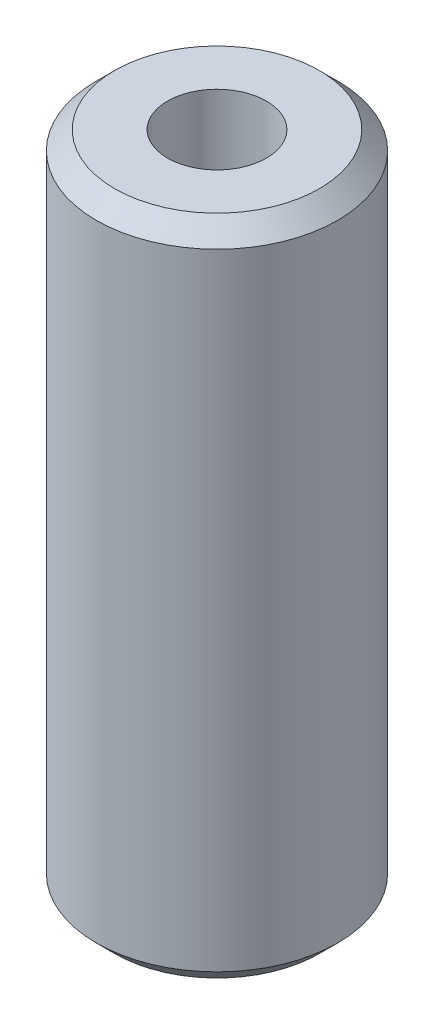
ISO-10303-21;
HEADER;
FILE_DESCRIPTION(('STEP AP214'),'2;1');
FILE_NAME('part.step','',(''),(''),'','','');
FILE_SCHEMA(('AUTOMOTIVE_DESIGN { 1 0 10303 214 1 1 1 1 }'));
ENDSEC;
DATA;
#1=APPLICATION_CONTEXT('core data for automotive mechanical design processes');
#2=APPLICATION_PROTOCOL_DEFINITION('international standard','automotive_design',2000,#1);
#3=PRODUCT_CONTEXT('',#1,'mechanical');
#4=PRODUCT('Part','Part','',(#3));
#5=PRODUCT_RELATED_PRODUCT_CATEGORY('part','',(#4));
#6=PRODUCT_DEFINITION_FORMATION('','',#4);
#7=PRODUCT_DEFINITION_CONTEXT('part definition',#1,'design');
#8=PRODUCT_DEFINITION('design','',#6,#7);
#9=PRODUCT_DEFINITION_SHAPE('','',#8);
#10=(LENGTH_UNIT() NAMED_UNIT(*) SI_UNIT(.MILLI.,.METRE.));
#11=(NAMED_UNIT(*) PLANE_ANGLE_UNIT() SI_UNIT($,.RADIAN.));
#12=(NAMED_UNIT(*) SI_UNIT($,.STERADIAN.) SOLID_ANGLE_UNIT());
#13=UNCERTAINTY_MEASURE_WITH_UNIT(LENGTH_MEASURE(1.E-05),#10,'distance_accuracy_value','');
#14=(GEOMETRIC_REPRESENTATION_CONTEXT(3) GLOBAL_UNCERTAINTY_ASSIGNED_CONTEXT((#13)) GLOBAL_UNIT_ASSIGNED_CONTEXT((#10,
#11,#12)) REPRESENTATION_CONTEXT('',''));
#15=CARTESIAN_POINT('',(0.,0.,0.));
#16=DIRECTION('',(0.,0.,1.));
#17=DIRECTION('',(1.,0.,0.));
#18=AXIS2_PLACEMENT_3D('',#15,#16,#17);
#19=CARTESIAN_POINT('',(0.,54.8902816735799,0.));
#20=DIRECTION('',(0.,-1.,0.));
#21=DIRECTION('',(0.,0.,-1.));
#22=AXIS2_PLACEMENT_3D('',#19,#20,#21);
#23=CYLINDRICAL_SURFACE('',#22,10.);
#24=CARTESIAN_POINT('',(0.,53.3745853184325,0.));
#25=DIRECTION('',(0.,1.,0.));
#26=DIRECTION('',(0.,0.,1.));
#27=AXIS2_PLACEMENT_3D('',#24,#25,#26);
#28=CIRCLE('',#27,10.);
#29=CARTESIAN_POINT('',(0.,53.3745853184325,10.));
#30=VERTEX_POINT('',#29);
#31=EDGE_CURVE('E50',#30,#30,#28,.F.);
#32=ORIENTED_EDGE('',*,*,#31,.T.);
#33=EDGE_LOOP('',(#32));
#34=FACE_BOUND('',#33,.T.);
#35=CARTESIAN_POINT('',(0.,1.51569635514739,0.));
#36=DIRECTION('',(0.,1.,0.));
#37=DIRECTION('',(0.,0.,1.));
#38=AXIS2_PLACEMENT_3D('',#35,#36,#37);
#39=CIRCLE('',#38,10.);
#40=CARTESIAN_POINT('',(0.,1.51569635514739,10.));
#41=VERTEX_POINT('',#40);
#42=EDGE_CURVE('E51',#41,#41,#39,.T.);
#43=ORIENTED_EDGE('',*,*,#42,.T.);
#44=EDGE_LOOP('',(#43));
#45=FACE_BOUND('',#44,.T.);
#46=ADVANCED_FACE('F39',(#34,#45),#23,.T.);
#47=CARTESIAN_POINT('',(0.,54.8902816735799,0.));
#48=DIRECTION('',(0.,1.,0.));
#49=DIRECTION('',(0.,0.,1.));
#50=AXIS2_PLACEMENT_3D('',#47,#48,#49);
#51=PLANE('',#50);
#52=CARTESIAN_POINT('',(0.,54.8902816735799,0.));
#53=DIRECTION('',(0.,1.,0.));
#54=DIRECTION('',(0.,0.,1.));
#55=AXIS2_PLACEMENT_3D('',#52,#53,#54);
#56=CIRCLE('',#55,8.48430364485261);
#57=CARTESIAN_POINT('',(0.,54.8902816735799,8.48430364485261));
#58=VERTEX_POINT('',#57);
#59=EDGE_CURVE('E54',#58,#58,#56,.T.);
#60=ORIENTED_EDGE('',*,*,#59,.T.);
#61=EDGE_LOOP('',(#60));
#62=FACE_BOUND('',#61,.T.);
#63=CARTESIAN_POINT('',(0.,54.8902816735799,0.));
#64=DIRECTION('',(0.,1.,0.));
#65=DIRECTION('',(0.,0.,1.));
#66=AXIS2_PLACEMENT_3D('',#63,#64,#65);
#67=CIRCLE('',#66,4.09878857925724);
#68=CARTESIAN_POINT('',(0.,54.8902816735799,4.09878857925724));
#69=VERTEX_POINT('',#68);
#70=EDGE_CURVE('E58',#69,#69,#67,.T.);
#71=ORIENTED_EDGE('',*,*,#70,.F.);
#72=EDGE_LOOP('',(#71));
#73=FACE_BOUND('',#72,.T.);
#74=ADVANCED_FACE('F69',(#62,#73),#51,.T.);
#75=CARTESIAN_POINT('',(0.,0.,0.));
#76=DIRECTION('',(0.,1.,0.));
#77=DIRECTION('',(0.,0.,1.));
#78=AXIS2_PLACEMENT_3D('',#75,#76,#77);
#79=PLANE('',#78);
#80=CARTESIAN_POINT('',(0.,0.,0.));
#81=DIRECTION('',(0.,1.,0.));
#82=DIRECTION('',(0.,0.,1.));
#83=AXIS2_PLACEMENT_3D('',#80,#81,#82);
#84=CIRCLE('',#83,8.48430364485259);
#85=CARTESIAN_POINT('',(0.,0.,8.48430364485259));
#86=VERTEX_POINT('',#85);
#87=EDGE_CURVE('E10',#86,#86,#84,.F.);
#88=ORIENTED_EDGE('',*,*,#87,.T.);
#89=EDGE_LOOP('',(#88));
#90=FACE_BOUND('',#89,.T.);
#91=CARTESIAN_POINT('',(0.,0.,0.));
#92=DIRECTION('',(0.,1.,0.));
#93=DIRECTION('',(0.,0.,1.));
#94=AXIS2_PLACEMENT_3D('',#91,#92,#93);
#95=CIRCLE('',#94,4.09878857925724);
#96=CARTESIAN_POINT('',(0.,0.,4.09878857925724));
#97=VERTEX_POINT('',#96);
#98=EDGE_CURVE('E63',#97,#97,#95,.T.);
#99=ORIENTED_EDGE('',*,*,#98,.T.);
#100=EDGE_LOOP('',(#99));
#101=FACE_BOUND('',#100,.T.);
#102=ADVANCED_FACE('F75',(#90,#101),#79,.F.);
#103=CARTESIAN_POINT('',(0.,54.8902816735799,0.));
#104=DIRECTION('',(0.,-1.,0.));
#105=DIRECTION('',(0.,0.,-1.));
#106=AXIS2_PLACEMENT_3D('',#103,#104,#105);
#107=CYLINDRICAL_SURFACE('',#106,4.09878857925724);
#108=ORIENTED_EDGE('',*,*,#70,.T.);
#109=EDGE_LOOP('',(#108));
#110=FACE_BOUND('',#109,.T.);
#111=ORIENTED_EDGE('',*,*,#98,.F.);
#112=EDGE_LOOP('',(#111));
#113=FACE_BOUND('',#112,.T.);
#114=ADVANCED_FACE('F70',(#110,#113),#107,.F.);
#115=CARTESIAN_POINT('',(0.,54.8902816735799,0.));
#116=DIRECTION('',(0.,-1.,0.));
#117=DIRECTION('',(0.,0.,-1.));
#118=AXIS2_PLACEMENT_3D('',#115,#116,#117);
#119=CONICAL_SURFACE('',#118,8.48430364485261,0.785398163397448);
#120=ORIENTED_EDGE('',*,*,#31,.F.);
#121=EDGE_LOOP('',(#120));
#122=FACE_BOUND('',#121,.T.);
#123=ORIENTED_EDGE('',*,*,#59,.F.);
#124=EDGE_LOOP('',(#123));
#125=FACE_BOUND('',#124,.T.);
#126=ADVANCED_FACE('F81',(#122,#125),#119,.T.);
#127=CARTESIAN_POINT('',(0.,1.51569635514739,0.));
#128=DIRECTION('',(0.,1.,0.));
#129=DIRECTION('',(0.,0.,1.));
#130=AXIS2_PLACEMENT_3D('',#127,#128,#129);
#131=CONICAL_SURFACE('',#130,10.,0.785398163397452);
#132=ORIENTED_EDGE('',*,*,#87,.F.);
#133=EDGE_LOOP('',(#132));
#134=FACE_BOUND('',#133,.T.);
#135=ORIENTED_EDGE('',*,*,#42,.F.);
#136=EDGE_LOOP('',(#135));
#137=FACE_BOUND('',#136,.T.);
#138=ADVANCED_FACE('F45',(#134,#137),#131,.T.);
#139=CLOSED_SHELL('',(#46,#74,#102,#114,#126,#138));
#140=MANIFOLD_SOLID_BREP('B2',#139);
#141=ADVANCED_BREP_SHAPE_REPRESENTATION('',(#18,#140),#14);
#142=SHAPE_DEFINITION_REPRESENTATION(#9,#141);
ENDSEC;
END-ISO-10303-21;
